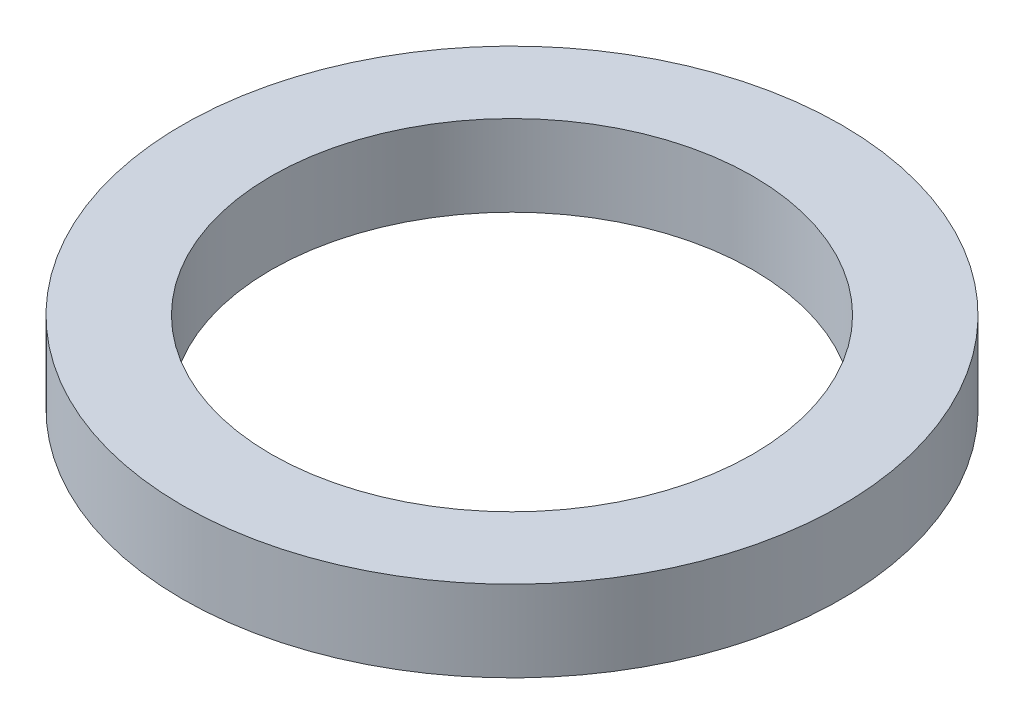
ISO-10303-21;
HEADER;
FILE_DESCRIPTION(('STEP AP214'),'2;1');
FILE_NAME('part.step','',(''),(''),'','','');
FILE_SCHEMA(('AUTOMOTIVE_DESIGN { 1 0 10303 214 1 1 1 1 }'));
ENDSEC;
DATA;
#1=APPLICATION_CONTEXT('core data for automotive mechanical design processes');
#2=APPLICATION_PROTOCOL_DEFINITION('international standard','automotive_design',2000,#1);
#3=PRODUCT_CONTEXT('',#1,'mechanical');
#4=PRODUCT('Part','Part','',(#3));
#5=PRODUCT_RELATED_PRODUCT_CATEGORY('part','',(#4));
#6=PRODUCT_DEFINITION_FORMATION('','',#4);
#7=PRODUCT_DEFINITION_CONTEXT('part definition',#1,'design');
#8=PRODUCT_DEFINITION('design','',#6,#7);
#9=PRODUCT_DEFINITION_SHAPE('','',#8);
#10=(LENGTH_UNIT() NAMED_UNIT(*) SI_UNIT(.MILLI.,.METRE.));
#11=(NAMED_UNIT(*) PLANE_ANGLE_UNIT() SI_UNIT($,.RADIAN.));
#12=(NAMED_UNIT(*) SI_UNIT($,.STERADIAN.) SOLID_ANGLE_UNIT());
#13=UNCERTAINTY_MEASURE_WITH_UNIT(LENGTH_MEASURE(1.E-05),#10,'distance_accuracy_value','');
#14=(GEOMETRIC_REPRESENTATION_CONTEXT(3) GLOBAL_UNCERTAINTY_ASSIGNED_CONTEXT((#13)) GLOBAL_UNIT_ASSIGNED_CONTEXT((#10,
#11,#12)) REPRESENTATION_CONTEXT('',''));
#15=CARTESIAN_POINT('',(0.,0.,0.));
#16=DIRECTION('',(0.,0.,1.));
#17=DIRECTION('',(1.,0.,0.));
#18=AXIS2_PLACEMENT_3D('',#15,#16,#17);
#19=CARTESIAN_POINT('',(0.,16.,0.));
#20=DIRECTION('',(0.,-1.,0.));
#21=DIRECTION('',(0.,0.,-1.));
#22=AXIS2_PLACEMENT_3D('',#19,#20,#21);
#23=CYLINDRICAL_SURFACE('',#22,65.);
#24=CARTESIAN_POINT('',(0.,16.,0.));
#25=DIRECTION('',(0.,1.,0.));
#26=DIRECTION('',(0.,0.,1.));
#27=AXIS2_PLACEMENT_3D('',#24,#25,#26);
#28=CIRCLE('',#27,65.);
#29=CARTESIAN_POINT('',(0.,16.,65.));
#30=VERTEX_POINT('',#29);
#31=EDGE_CURVE('E10',#30,#30,#28,.T.);
#32=ORIENTED_EDGE('',*,*,#31,.F.);
#33=EDGE_LOOP('',(#32));
#34=FACE_BOUND('',#33,.T.);
#35=CARTESIAN_POINT('',(0.,0.,0.));
#36=DIRECTION('',(0.,1.,0.));
#37=DIRECTION('',(0.,0.,1.));
#38=AXIS2_PLACEMENT_3D('',#35,#36,#37);
#39=CIRCLE('',#38,65.);
#40=CARTESIAN_POINT('',(0.,0.,65.));
#41=VERTEX_POINT('',#40);
#42=EDGE_CURVE('E37',#41,#41,#39,.T.);
#43=ORIENTED_EDGE('',*,*,#42,.T.);
#44=EDGE_LOOP('',(#43));
#45=FACE_BOUND('',#44,.T.);
#46=ADVANCED_FACE('F40',(#34,#45),#23,.T.);
#47=CARTESIAN_POINT('',(0.,16.,0.));
#48=DIRECTION('',(0.,1.,0.));
#49=DIRECTION('',(0.,0.,1.));
#50=AXIS2_PLACEMENT_3D('',#47,#48,#49);
#51=PLANE('',#50);
#52=CARTESIAN_POINT('',(0.,16.,0.));
#53=DIRECTION('',(0.,1.,0.));
#54=DIRECTION('',(0.,0.,1.));
#55=AXIS2_PLACEMENT_3D('',#52,#53,#54);
#56=CIRCLE('',#55,47.5);
#57=CARTESIAN_POINT('',(0.,16.,47.5));
#58=VERTEX_POINT('',#57);
#59=EDGE_CURVE('E50',#58,#58,#56,.T.);
#60=ORIENTED_EDGE('',*,*,#59,.F.);
#61=EDGE_LOOP('',(#60));
#62=FACE_BOUND('',#61,.T.);
#63=ORIENTED_EDGE('',*,*,#31,.T.);
#64=EDGE_LOOP('',(#63));
#65=FACE_BOUND('',#64,.T.);
#66=ADVANCED_FACE('F59',(#62,#65),#51,.T.);
#67=CARTESIAN_POINT('',(0.,0.,0.));
#68=DIRECTION('',(0.,1.,0.));
#69=DIRECTION('',(0.,0.,1.));
#70=AXIS2_PLACEMENT_3D('',#67,#68,#69);
#71=PLANE('',#70);
#72=CARTESIAN_POINT('',(0.,0.,0.));
#73=DIRECTION('',(0.,1.,0.));
#74=DIRECTION('',(0.,0.,1.));
#75=AXIS2_PLACEMENT_3D('',#72,#73,#74);
#76=CIRCLE('',#75,47.5);
#77=CARTESIAN_POINT('',(0.,0.,47.5));
#78=VERTEX_POINT('',#77);
#79=EDGE_CURVE('E47',#78,#78,#76,.T.);
#80=ORIENTED_EDGE('',*,*,#79,.T.);
#81=EDGE_LOOP('',(#80));
#82=FACE_BOUND('',#81,.T.);
#83=ORIENTED_EDGE('',*,*,#42,.F.);
#84=EDGE_LOOP('',(#83));
#85=FACE_BOUND('',#84,.T.);
#86=ADVANCED_FACE('F58',(#82,#85),#71,.F.);
#87=CARTESIAN_POINT('',(0.,16.,0.));
#88=DIRECTION('',(0.,-1.,0.));
#89=DIRECTION('',(0.,0.,-1.));
#90=AXIS2_PLACEMENT_3D('',#87,#88,#89);
#91=CYLINDRICAL_SURFACE('',#90,47.5);
#92=ORIENTED_EDGE('',*,*,#59,.T.);
#93=EDGE_LOOP('',(#92));
#94=FACE_BOUND('',#93,.T.);
#95=ORIENTED_EDGE('',*,*,#79,.F.);
#96=EDGE_LOOP('',(#95));
#97=FACE_BOUND('',#96,.T.);
#98=ADVANCED_FACE('F54',(#94,#97),#91,.F.);
#99=CLOSED_SHELL('',(#46,#66,#86,#98));
#100=MANIFOLD_SOLID_BREP('B2',#99);
#101=ADVANCED_BREP_SHAPE_REPRESENTATION('',(#18,#100),#14);
#102=SHAPE_DEFINITION_REPRESENTATION(#9,#101);
ENDSEC;
END-ISO-10303-21;
